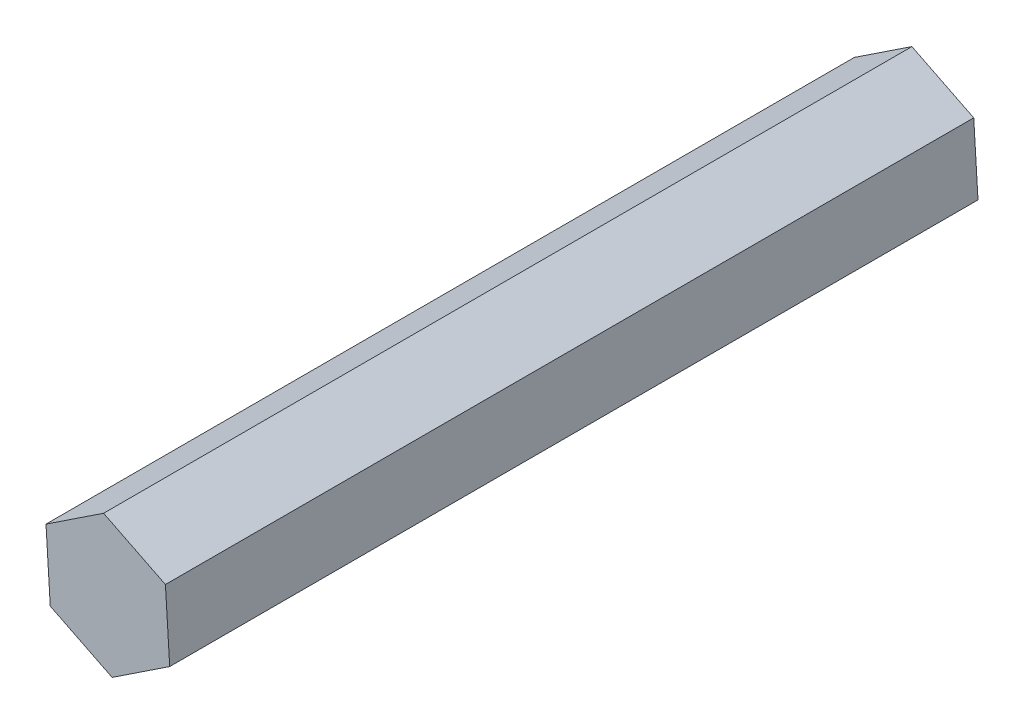
ISO-10303-21;
HEADER;
FILE_DESCRIPTION(('STEP AP214'),'2;1');
FILE_NAME('part.step','',(''),(''),'','','');
FILE_SCHEMA(('AUTOMOTIVE_DESIGN { 1 0 10303 214 1 1 1 1 }'));
ENDSEC;
DATA;
#1=APPLICATION_CONTEXT('core data for automotive mechanical design processes');
#2=APPLICATION_PROTOCOL_DEFINITION('international standard','automotive_design',2000,#1);
#3=PRODUCT_CONTEXT('',#1,'mechanical');
#4=PRODUCT('Part','Part','',(#3));
#5=PRODUCT_RELATED_PRODUCT_CATEGORY('part','',(#4));
#6=PRODUCT_DEFINITION_FORMATION('','',#4);
#7=PRODUCT_DEFINITION_CONTEXT('part definition',#1,'design');
#8=PRODUCT_DEFINITION('design','',#6,#7);
#9=PRODUCT_DEFINITION_SHAPE('','',#8);
#10=(LENGTH_UNIT() NAMED_UNIT(*) SI_UNIT(.MILLI.,.METRE.));
#11=(NAMED_UNIT(*) PLANE_ANGLE_UNIT() SI_UNIT($,.RADIAN.));
#12=(NAMED_UNIT(*) SI_UNIT($,.STERADIAN.) SOLID_ANGLE_UNIT());
#13=UNCERTAINTY_MEASURE_WITH_UNIT(LENGTH_MEASURE(1.E-05),#10,'distance_accuracy_value','');
#14=(GEOMETRIC_REPRESENTATION_CONTEXT(3) GLOBAL_UNCERTAINTY_ASSIGNED_CONTEXT((#13)) GLOBAL_UNIT_ASSIGNED_CONTEXT((#10,
#11,#12)) REPRESENTATION_CONTEXT('',''));
#15=CARTESIAN_POINT('',(0.,0.,0.));
#16=DIRECTION('',(0.,0.,1.));
#17=DIRECTION('',(1.,0.,0.));
#18=AXIS2_PLACEMENT_3D('',#15,#16,#17);
#19=CARTESIAN_POINT('',(6.12625840732226,4.0609676096607,86.));
#20=DIRECTION('',(-0.445579810348125,-0.895242220077968,0.));
#21=DIRECTION('',(0.895242220077968,-0.445579810348125,0.));
#22=AXIS2_PLACEMENT_3D('',#19,#20,#21);
#23=PLANE('',#22);
#24=DIRECTION('',(-0.895242220077968,0.445579810348125,0.));
#25=VECTOR('',#24,1.);
#26=CARTESIAN_POINT('',(6.12625840732226,4.0609676096607,0.));
#27=LINE('',#26,#25);
#28=CARTESIAN_POINT('',(6.12625840732226,4.0609676096607,0.));
#29=VERTEX_POINT('',#28);
#30=CARTESIAN_POINT('',(-0.453771910250806,7.33597921571942,0.));
#31=VERTEX_POINT('',#30);
#32=EDGE_CURVE('E122',#29,#31,#27,.T.);
#33=ORIENTED_EDGE('',*,*,#32,.T.);
#34=DIRECTION('',(0.,0.,-1.));
#35=VECTOR('',#34,1.);
#36=CARTESIAN_POINT('',(-0.453771910250806,7.33597921571942,86.));
#37=LINE('',#36,#35);
#38=CARTESIAN_POINT('',(-0.453771910250806,7.33597921571942,86.));
#39=VERTEX_POINT('',#38);
#40=EDGE_CURVE('E11',#39,#31,#37,.T.);
#41=ORIENTED_EDGE('',*,*,#40,.F.);
#42=DIRECTION('',(-0.895242220077968,0.445579810348125,0.));
#43=VECTOR('',#42,1.);
#44=CARTESIAN_POINT('',(6.12625840732226,4.0609676096607,86.));
#45=LINE('',#44,#43);
#46=CARTESIAN_POINT('',(6.12625840732226,4.0609676096607,86.));
#47=VERTEX_POINT('',#46);
#48=EDGE_CURVE('E135',#47,#39,#45,.T.);
#49=ORIENTED_EDGE('',*,*,#48,.F.);
#50=DIRECTION('',(0.,0.,-1.));
#51=VECTOR('',#50,1.);
#52=CARTESIAN_POINT('',(6.12625840732226,4.0609676096607,86.));
#53=LINE('',#52,#51);
#54=EDGE_CURVE('E118',#47,#29,#53,.T.);
#55=ORIENTED_EDGE('',*,*,#54,.T.);
#56=EDGE_LOOP('',(#33,#41,#49,#55));
#57=FACE_BOUND('',#56,.T.);
#58=ADVANCED_FACE('F39',(#57),#23,.F.);
#59=CARTESIAN_POINT('',(-0.453771910250806,7.33597921571942,86.));
#60=DIRECTION('',(0.552512599953837,-0.833504545213913,0.));
#61=DIRECTION('',(0.833504545213913,0.552512599953837,0.));
#62=AXIS2_PLACEMENT_3D('',#59,#60,#61);
#63=PLANE('',#62);
#64=DIRECTION('',(-0.833504545213913,-0.552512599953837,0.));
#65=VECTOR('',#64,1.);
#66=CARTESIAN_POINT('',(-0.453771910250806,7.33597921571942,0.));
#67=LINE('',#66,#65);
#68=CARTESIAN_POINT('',(-6.58003031757306,3.27501160605872,0.));
#69=VERTEX_POINT('',#68);
#70=EDGE_CURVE('E127',#31,#69,#67,.T.);
#71=ORIENTED_EDGE('',*,*,#70,.T.);
#72=DIRECTION('',(0.,0.,-1.));
#73=VECTOR('',#72,1.);
#74=CARTESIAN_POINT('',(-6.58003031757306,3.27501160605872,86.));
#75=LINE('',#74,#73);
#76=CARTESIAN_POINT('',(-6.58003031757306,3.27501160605872,86.));
#77=VERTEX_POINT('',#76);
#78=EDGE_CURVE('E50',#77,#69,#75,.T.);
#79=ORIENTED_EDGE('',*,*,#78,.F.);
#80=DIRECTION('',(-0.833504545213913,-0.552512599953837,0.));
#81=VECTOR('',#80,1.);
#82=CARTESIAN_POINT('',(-0.453771910250806,7.33597921571942,86.));
#83=LINE('',#82,#81);
#84=EDGE_CURVE('E95',#39,#77,#83,.T.);
#85=ORIENTED_EDGE('',*,*,#84,.F.);
#86=ORIENTED_EDGE('',*,*,#40,.T.);
#87=EDGE_LOOP('',(#71,#79,#85,#86));
#88=FACE_BOUND('',#87,.T.);
#89=ADVANCED_FACE('F160',(#88),#63,.F.);
#90=CARTESIAN_POINT('',(-6.58003031757306,3.27501160605872,86.));
#91=DIRECTION('',(0.998092410301962,0.0617376748640551,0.));
#92=DIRECTION('',(-0.0617376748640551,0.998092410301962,0.));
#93=AXIS2_PLACEMENT_3D('',#90,#91,#92);
#94=PLANE('',#93);
#95=DIRECTION('',(0.0617376748640551,-0.998092410301962,0.));
#96=VECTOR('',#95,1.);
#97=CARTESIAN_POINT('',(-6.58003031757306,3.27501160605872,0.));
#98=LINE('',#97,#96);
#99=CARTESIAN_POINT('',(-6.12625840732226,-4.0609676096607,0.));
#100=VERTEX_POINT('',#99);
#101=EDGE_CURVE('E126',#69,#100,#98,.T.);
#102=ORIENTED_EDGE('',*,*,#101,.T.);
#103=DIRECTION('',(0.,0.,-1.));
#104=VECTOR('',#103,1.);
#105=CARTESIAN_POINT('',(-6.12625840732226,-4.0609676096607,86.));
#106=LINE('',#105,#104);
#107=CARTESIAN_POINT('',(-6.12625840732226,-4.0609676096607,86.));
#108=VERTEX_POINT('',#107);
#109=EDGE_CURVE('E111',#108,#100,#106,.T.);
#110=ORIENTED_EDGE('',*,*,#109,.F.);
#111=DIRECTION('',(0.0617376748640551,-0.998092410301962,0.));
#112=VECTOR('',#111,1.);
#113=CARTESIAN_POINT('',(-6.58003031757306,3.27501160605872,86.));
#114=LINE('',#113,#112);
#115=EDGE_CURVE('E104',#77,#108,#114,.T.);
#116=ORIENTED_EDGE('',*,*,#115,.F.);
#117=ORIENTED_EDGE('',*,*,#78,.T.);
#118=EDGE_LOOP('',(#102,#110,#116,#117));
#119=FACE_BOUND('',#118,.T.);
#120=ADVANCED_FACE('F138',(#119),#94,.F.);
#121=CARTESIAN_POINT('',(-6.12625840732226,-4.0609676096607,86.));
#122=DIRECTION('',(0.445579810348126,0.895242220077968,0.));
#123=DIRECTION('',(-0.895242220077968,0.445579810348126,0.));
#124=AXIS2_PLACEMENT_3D('',#121,#122,#123);
#125=PLANE('',#124);
#126=DIRECTION('',(0.895242220077968,-0.445579810348126,0.));
#127=VECTOR('',#126,1.);
#128=CARTESIAN_POINT('',(-6.12625840732226,-4.0609676096607,0.));
#129=LINE('',#128,#127);
#130=CARTESIAN_POINT('',(0.453771910250804,-7.33597921571942,0.));
#131=VERTEX_POINT('',#130);
#132=EDGE_CURVE('E114',#100,#131,#129,.T.);
#133=ORIENTED_EDGE('',*,*,#132,.T.);
#134=DIRECTION('',(0.,0.,-1.));
#135=VECTOR('',#134,1.);
#136=CARTESIAN_POINT('',(0.453771910250804,-7.33597921571942,86.));
#137=LINE('',#136,#135);
#138=CARTESIAN_POINT('',(0.453771910250804,-7.33597921571942,86.));
#139=VERTEX_POINT('',#138);
#140=EDGE_CURVE('E109',#139,#131,#137,.T.);
#141=ORIENTED_EDGE('',*,*,#140,.F.);
#142=DIRECTION('',(0.895242220077968,-0.445579810348126,0.));
#143=VECTOR('',#142,1.);
#144=CARTESIAN_POINT('',(-6.12625840732226,-4.0609676096607,86.));
#145=LINE('',#144,#143);
#146=EDGE_CURVE('E97',#108,#139,#145,.T.);
#147=ORIENTED_EDGE('',*,*,#146,.F.);
#148=ORIENTED_EDGE('',*,*,#109,.T.);
#149=EDGE_LOOP('',(#133,#141,#147,#148));
#150=FACE_BOUND('',#149,.T.);
#151=ADVANCED_FACE('F112',(#150),#125,.F.);
#152=CARTESIAN_POINT('',(0.453771910250804,-7.33597921571942,86.));
#153=DIRECTION('',(-0.552512599953837,0.833504545213913,0.));
#154=DIRECTION('',(-0.833504545213913,-0.552512599953837,0.));
#155=AXIS2_PLACEMENT_3D('',#152,#153,#154);
#156=PLANE('',#155);
#157=DIRECTION('',(0.833504545213913,0.552512599953837,0.));
#158=VECTOR('',#157,1.);
#159=CARTESIAN_POINT('',(0.453771910250804,-7.33597921571942,0.));
#160=LINE('',#159,#158);
#161=CARTESIAN_POINT('',(6.58003031757306,-3.27501160605872,0.));
#162=VERTEX_POINT('',#161);
#163=EDGE_CURVE('E80',#131,#162,#160,.T.);
#164=ORIENTED_EDGE('',*,*,#163,.T.);
#165=DIRECTION('',(0.,0.,-1.));
#166=VECTOR('',#165,1.);
#167=CARTESIAN_POINT('',(6.58003031757306,-3.27501160605872,86.));
#168=LINE('',#167,#166);
#169=CARTESIAN_POINT('',(6.58003031757306,-3.27501160605872,86.));
#170=VERTEX_POINT('',#169);
#171=EDGE_CURVE('E113',#170,#162,#168,.T.);
#172=ORIENTED_EDGE('',*,*,#171,.F.);
#173=DIRECTION('',(0.833504545213913,0.552512599953837,0.));
#174=VECTOR('',#173,1.);
#175=CARTESIAN_POINT('',(0.453771910250804,-7.33597921571942,86.));
#176=LINE('',#175,#174);
#177=EDGE_CURVE('E103',#139,#170,#176,.T.);
#178=ORIENTED_EDGE('',*,*,#177,.F.);
#179=ORIENTED_EDGE('',*,*,#140,.T.);
#180=EDGE_LOOP('',(#164,#172,#178,#179));
#181=FACE_BOUND('',#180,.T.);
#182=ADVANCED_FACE('F116',(#181),#156,.F.);
#183=CARTESIAN_POINT('',(6.58003031757306,-3.27501160605872,86.));
#184=DIRECTION('',(-0.998092410301962,-0.0617376748640547,0.));
#185=DIRECTION('',(0.0617376748640547,-0.998092410301962,0.));
#186=AXIS2_PLACEMENT_3D('',#183,#184,#185);
#187=PLANE('',#186);
#188=DIRECTION('',(-0.0617376748640547,0.998092410301962,0.));
#189=VECTOR('',#188,1.);
#190=CARTESIAN_POINT('',(6.58003031757306,-3.27501160605872,0.));
#191=LINE('',#190,#189);
#192=EDGE_CURVE('E83',#162,#29,#191,.T.);
#193=ORIENTED_EDGE('',*,*,#192,.T.);
#194=ORIENTED_EDGE('',*,*,#54,.F.);
#195=DIRECTION('',(-0.0617376748640547,0.998092410301962,0.));
#196=VECTOR('',#195,1.);
#197=CARTESIAN_POINT('',(6.58003031757306,-3.27501160605872,86.));
#198=LINE('',#197,#196);
#199=EDGE_CURVE('E54',#170,#47,#198,.T.);
#200=ORIENTED_EDGE('',*,*,#199,.F.);
#201=ORIENTED_EDGE('',*,*,#171,.T.);
#202=EDGE_LOOP('',(#193,#194,#200,#201));
#203=FACE_BOUND('',#202,.T.);
#204=ADVANCED_FACE('F148',(#203),#187,.F.);
#205=CARTESIAN_POINT('',(0.,0.,86.));
#206=DIRECTION('',(0.,0.,1.));
#207=DIRECTION('',(1.,0.,0.));
#208=AXIS2_PLACEMENT_3D('',#205,#206,#207);
#209=PLANE('',#208);
#210=ORIENTED_EDGE('',*,*,#48,.T.);
#211=ORIENTED_EDGE('',*,*,#84,.T.);
#212=ORIENTED_EDGE('',*,*,#115,.T.);
#213=ORIENTED_EDGE('',*,*,#146,.T.);
#214=ORIENTED_EDGE('',*,*,#177,.T.);
#215=ORIENTED_EDGE('',*,*,#199,.T.);
#216=EDGE_LOOP('',(#210,#211,#212,#213,#214,#215));
#217=FACE_BOUND('',#216,.T.);
#218=ADVANCED_FACE('F101',(#217),#209,.T.);
#219=CARTESIAN_POINT('',(0.,0.,0.));
#220=DIRECTION('',(0.,0.,1.));
#221=DIRECTION('',(1.,0.,0.));
#222=AXIS2_PLACEMENT_3D('',#219,#220,#221);
#223=PLANE('',#222);
#224=ORIENTED_EDGE('',*,*,#32,.F.);
#225=ORIENTED_EDGE('',*,*,#192,.F.);
#226=ORIENTED_EDGE('',*,*,#163,.F.);
#227=ORIENTED_EDGE('',*,*,#132,.F.);
#228=ORIENTED_EDGE('',*,*,#101,.F.);
#229=ORIENTED_EDGE('',*,*,#70,.F.);
#230=EDGE_LOOP('',(#224,#225,#226,#227,#228,#229));
#231=FACE_BOUND('',#230,.T.);
#232=ADVANCED_FACE('F142',(#231),#223,.F.);
#233=CLOSED_SHELL('',(#58,#89,#120,#151,#182,#204,#218,#232));
#234=MANIFOLD_SOLID_BREP('B2',#233);
#235=ADVANCED_BREP_SHAPE_REPRESENTATION('',(#18,#234),#14);
#236=SHAPE_DEFINITION_REPRESENTATION(#9,#235);
ENDSEC;
END-ISO-10303-21;
